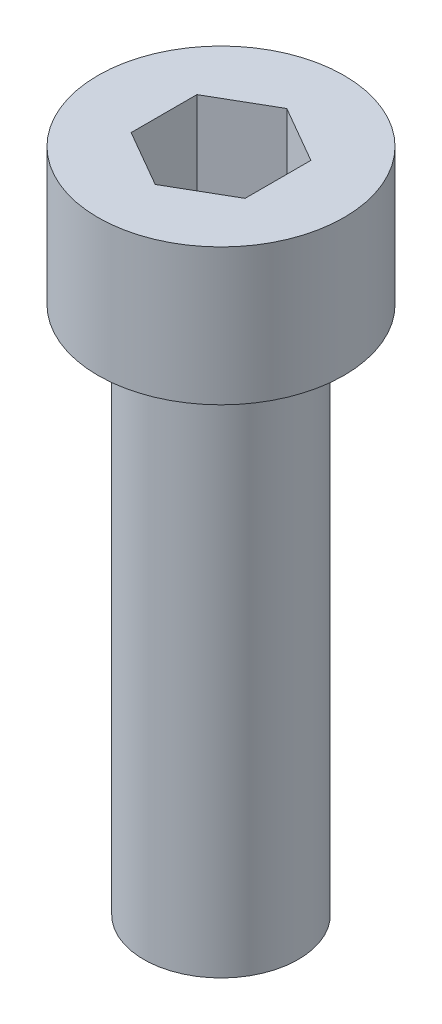
ISO-10303-21;
HEADER;
FILE_DESCRIPTION(('STEP AP214'),'2;1');
FILE_NAME('part.step','',(''),(''),'','','');
FILE_SCHEMA(('AUTOMOTIVE_DESIGN { 1 0 10303 214 1 1 1 1 }'));
ENDSEC;
DATA;
#1=APPLICATION_CONTEXT('core data for automotive mechanical design processes');
#2=APPLICATION_PROTOCOL_DEFINITION('international standard','automotive_design',2000,#1);
#3=PRODUCT_CONTEXT('',#1,'mechanical');
#4=PRODUCT('Part','Part','',(#3));
#5=PRODUCT_RELATED_PRODUCT_CATEGORY('part','',(#4));
#6=PRODUCT_DEFINITION_FORMATION('','',#4);
#7=PRODUCT_DEFINITION_CONTEXT('part definition',#1,'design');
#8=PRODUCT_DEFINITION('design','',#6,#7);
#9=PRODUCT_DEFINITION_SHAPE('','',#8);
#10=(LENGTH_UNIT() NAMED_UNIT(*) SI_UNIT(.MILLI.,.METRE.));
#11=(NAMED_UNIT(*) PLANE_ANGLE_UNIT() SI_UNIT($,.RADIAN.));
#12=(NAMED_UNIT(*) SI_UNIT($,.STERADIAN.) SOLID_ANGLE_UNIT());
#13=UNCERTAINTY_MEASURE_WITH_UNIT(LENGTH_MEASURE(1.E-05),#10,'distance_accuracy_value','');
#14=(GEOMETRIC_REPRESENTATION_CONTEXT(3) GLOBAL_UNCERTAINTY_ASSIGNED_CONTEXT((#13)) GLOBAL_UNIT_ASSIGNED_CONTEXT((#10,
#11,#12)) REPRESENTATION_CONTEXT('',''));
#15=CARTESIAN_POINT('',(0.,0.,0.));
#16=DIRECTION('',(0.,0.,1.));
#17=DIRECTION('',(1.,0.,0.));
#18=AXIS2_PLACEMENT_3D('',#15,#16,#17);
#19=CARTESIAN_POINT('',(184.714490271524,-3.,125.244295140347));
#20=DIRECTION('',(0.,1.,0.));
#21=DIRECTION('',(0.,0.,1.));
#22=AXIS2_PLACEMENT_3D('',#19,#20,#21);
#23=CYLINDRICAL_SURFACE('',#22,2.70000000000001);
#24=CARTESIAN_POINT('',(184.714490271524,-3.,125.244295140347));
#25=DIRECTION('',(0.,1.,0.));
#26=DIRECTION('',(0.,0.,1.));
#27=AXIS2_PLACEMENT_3D('',#24,#25,#26);
#28=CIRCLE('',#27,2.70000000000001);
#29=CARTESIAN_POINT('',(184.714490271524,-3.,127.944295140347));
#30=VERTEX_POINT('',#29);
#31=EDGE_CURVE('E48',#30,#30,#28,.T.);
#32=ORIENTED_EDGE('',*,*,#31,.T.);
#33=EDGE_LOOP('',(#32));
#34=FACE_BOUND('',#33,.T.);
#35=CARTESIAN_POINT('',(184.714490271524,0.,125.244295140347));
#36=DIRECTION('',(0.,1.,0.));
#37=DIRECTION('',(0.,0.,1.));
#38=AXIS2_PLACEMENT_3D('',#35,#36,#37);
#39=CIRCLE('',#38,2.70000000000001);
#40=CARTESIAN_POINT('',(184.714490271524,0.,127.944295140347));
#41=VERTEX_POINT('',#40);
#42=EDGE_CURVE('E42',#41,#41,#39,.T.);
#43=ORIENTED_EDGE('',*,*,#42,.F.);
#44=EDGE_LOOP('',(#43));
#45=FACE_BOUND('',#44,.T.);
#46=ADVANCED_FACE('F39',(#34,#45),#23,.T.);
#47=CARTESIAN_POINT('',(184.714490271524,-3.,125.244295140347));
#48=DIRECTION('',(0.,1.,0.));
#49=DIRECTION('',(0.,0.,1.));
#50=AXIS2_PLACEMENT_3D('',#47,#48,#49);
#51=PLANE('',#50);
#52=CARTESIAN_POINT('',(184.714490271524,-3.,125.244295140347));
#53=DIRECTION('',(0.,-1.,0.));
#54=DIRECTION('',(0.,0.,-1.));
#55=AXIS2_PLACEMENT_3D('',#52,#53,#54);
#56=CIRCLE('',#55,1.69629374220996);
#57=CARTESIAN_POINT('',(184.714490271524,-3.,123.548001398137));
#58=VERTEX_POINT('',#57);
#59=EDGE_CURVE('E11',#58,#58,#56,.T.);
#60=ORIENTED_EDGE('',*,*,#59,.F.);
#61=EDGE_LOOP('',(#60));
#62=FACE_BOUND('',#61,.T.);
#63=ORIENTED_EDGE('',*,*,#31,.F.);
#64=EDGE_LOOP('',(#63));
#65=FACE_BOUND('',#64,.T.);
#66=ADVANCED_FACE('F184',(#62,#65),#51,.F.);
#67=CARTESIAN_POINT('',(184.714490271524,0.,125.244295140347));
#68=DIRECTION('',(0.,1.,0.));
#69=DIRECTION('',(0.,0.,1.));
#70=AXIS2_PLACEMENT_3D('',#67,#68,#69);
#71=PLANE('',#70);
#72=DIRECTION('',(-0.866025403784435,0.,-0.500000000000006));
#73=VECTOR('',#72,1.);
#74=CARTESIAN_POINT('',(185.964490271524,0.,124.52260730386));
#75=LINE('',#74,#73);
#76=CARTESIAN_POINT('',(185.964490271524,0.,124.52260730386));
#77=VERTEX_POINT('',#76);
#78=CARTESIAN_POINT('',(184.714490271524,0.,123.800919467373));
#79=VERTEX_POINT('',#78);
#80=EDGE_CURVE('E59',#77,#79,#75,.T.);
#81=ORIENTED_EDGE('',*,*,#80,.F.);
#82=DIRECTION('',(0.,0.,-1.));
#83=VECTOR('',#82,1.);
#84=CARTESIAN_POINT('',(185.964490271524,0.,125.965982976834));
#85=LINE('',#84,#83);
#86=CARTESIAN_POINT('',(185.964490271524,0.,125.965982976834));
#87=VERTEX_POINT('',#86);
#88=EDGE_CURVE('E158',#87,#77,#85,.T.);
#89=ORIENTED_EDGE('',*,*,#88,.F.);
#90=DIRECTION('',(0.86602540378443,0.,-0.500000000000015));
#91=VECTOR('',#90,1.);
#92=CARTESIAN_POINT('',(184.714490271524,0.,126.687670813321));
#93=LINE('',#92,#91);
#94=CARTESIAN_POINT('',(184.714490271524,0.,126.687670813321));
#95=VERTEX_POINT('',#94);
#96=EDGE_CURVE('E156',#95,#87,#93,.T.);
#97=ORIENTED_EDGE('',*,*,#96,.F.);
#98=DIRECTION('',(0.866025403784436,0.,0.500000000000004));
#99=VECTOR('',#98,1.);
#100=CARTESIAN_POINT('',(183.464490271524,0.,125.965982976834));
#101=LINE('',#100,#99);
#102=CARTESIAN_POINT('',(183.464490271524,0.,125.965982976834));
#103=VERTEX_POINT('',#102);
#104=EDGE_CURVE('E114',#103,#95,#101,.T.);
#105=ORIENTED_EDGE('',*,*,#104,.F.);
#106=DIRECTION('',(0.,0.,1.));
#107=VECTOR('',#106,1.);
#108=CARTESIAN_POINT('',(183.464490271524,0.,124.52260730386));
#109=LINE('',#108,#107);
#110=CARTESIAN_POINT('',(183.464490271524,0.,124.52260730386));
#111=VERTEX_POINT('',#110);
#112=EDGE_CURVE('E150',#111,#103,#109,.T.);
#113=ORIENTED_EDGE('',*,*,#112,.F.);
#114=DIRECTION('',(-0.86602540378444,0.,0.499999999999998));
#115=VECTOR('',#114,1.);
#116=CARTESIAN_POINT('',(184.714490271524,0.,123.800919467373));
#117=LINE('',#116,#115);
#118=EDGE_CURVE('E146',#79,#111,#117,.T.);
#119=ORIENTED_EDGE('',*,*,#118,.F.);
#120=EDGE_LOOP('',(#81,#89,#97,#105,#113,#119));
#121=FACE_BOUND('',#120,.T.);
#122=ORIENTED_EDGE('',*,*,#42,.T.);
#123=EDGE_LOOP('',(#122));
#124=FACE_BOUND('',#123,.T.);
#125=ADVANCED_FACE('F181',(#121,#124),#71,.T.);
#126=CARTESIAN_POINT('',(184.714490271524,-14.6,125.244295140347));
#127=DIRECTION('',(0.,1.,0.));
#128=DIRECTION('',(0.,0.,1.));
#129=AXIS2_PLACEMENT_3D('',#126,#127,#128);
#130=CYLINDRICAL_SURFACE('',#129,1.69629374220996);
#131=CARTESIAN_POINT('',(184.714490271524,-14.6,125.244295140347));
#132=DIRECTION('',(0.,-1.,0.));
#133=DIRECTION('',(0.,0.,-1.));
#134=AXIS2_PLACEMENT_3D('',#131,#132,#133);
#135=CIRCLE('',#134,1.69629374220996);
#136=CARTESIAN_POINT('',(184.714490271524,-14.6,123.548001398137));
#137=VERTEX_POINT('',#136);
#138=EDGE_CURVE('E164',#137,#137,#135,.T.);
#139=ORIENTED_EDGE('',*,*,#138,.F.);
#140=EDGE_LOOP('',(#139));
#141=FACE_BOUND('',#140,.T.);
#142=ORIENTED_EDGE('',*,*,#59,.T.);
#143=EDGE_LOOP('',(#142));
#144=FACE_BOUND('',#143,.T.);
#145=ADVANCED_FACE('F193',(#141,#144),#130,.T.);
#146=CARTESIAN_POINT('',(184.714490271524,-14.6,125.244295140347));
#147=DIRECTION('',(0.,-1.,0.));
#148=DIRECTION('',(0.,0.,-1.));
#149=AXIS2_PLACEMENT_3D('',#146,#147,#148);
#150=PLANE('',#149);
#151=ORIENTED_EDGE('',*,*,#138,.T.);
#152=EDGE_LOOP('',(#151));
#153=FACE_BOUND('',#152,.T.);
#154=ADVANCED_FACE('F200',(#153),#150,.T.);
#155=CARTESIAN_POINT('',(185.964490271524,-2.,124.52260730386));
#156=DIRECTION('',(0.500000000000006,0.,-0.866025403784435));
#157=DIRECTION('',(-0.866025403784435,0.,-0.500000000000006));
#158=AXIS2_PLACEMENT_3D('',#155,#156,#157);
#159=PLANE('',#158);
#160=ORIENTED_EDGE('',*,*,#80,.T.);
#161=DIRECTION('',(0.,1.,0.));
#162=VECTOR('',#161,1.);
#163=CARTESIAN_POINT('',(184.714490271524,-2.,123.800919467373));
#164=LINE('',#163,#162);
#165=CARTESIAN_POINT('',(184.714490271524,-2.,123.800919467373));
#166=VERTEX_POINT('',#165);
#167=EDGE_CURVE('E96',#166,#79,#164,.T.);
#168=ORIENTED_EDGE('',*,*,#167,.F.);
#169=DIRECTION('',(-0.866025403784435,0.,-0.500000000000006));
#170=VECTOR('',#169,1.);
#171=CARTESIAN_POINT('',(185.964490271524,-2.,124.52260730386));
#172=LINE('',#171,#170);
#173=CARTESIAN_POINT('',(185.964490271524,-2.,124.52260730386));
#174=VERTEX_POINT('',#173);
#175=EDGE_CURVE('E161',#174,#166,#172,.T.);
#176=ORIENTED_EDGE('',*,*,#175,.F.);
#177=DIRECTION('',(0.,1.,0.));
#178=VECTOR('',#177,1.);
#179=CARTESIAN_POINT('',(185.964490271524,-2.,124.52260730386));
#180=LINE('',#179,#178);
#181=EDGE_CURVE('E70',#174,#77,#180,.T.);
#182=ORIENTED_EDGE('',*,*,#181,.T.);
#183=EDGE_LOOP('',(#160,#168,#176,#182));
#184=FACE_BOUND('',#183,.T.);
#185=ADVANCED_FACE('F204',(#184),#159,.F.);
#186=CARTESIAN_POINT('',(185.964490271524,-2.,125.965982976834));
#187=DIRECTION('',(1.,0.,0.));
#188=DIRECTION('',(0.,0.,-1.));
#189=AXIS2_PLACEMENT_3D('',#186,#187,#188);
#190=PLANE('',#189);
#191=ORIENTED_EDGE('',*,*,#88,.T.);
#192=ORIENTED_EDGE('',*,*,#181,.F.);
#193=DIRECTION('',(0.,0.,-1.));
#194=VECTOR('',#193,1.);
#195=CARTESIAN_POINT('',(185.964490271524,-2.,125.965982976834));
#196=LINE('',#195,#194);
#197=CARTESIAN_POINT('',(185.964490271524,-2.,125.965982976834));
#198=VERTEX_POINT('',#197);
#199=EDGE_CURVE('E127',#198,#174,#196,.T.);
#200=ORIENTED_EDGE('',*,*,#199,.F.);
#201=DIRECTION('',(0.,1.,0.));
#202=VECTOR('',#201,1.);
#203=CARTESIAN_POINT('',(185.964490271524,-2.,125.965982976834));
#204=LINE('',#203,#202);
#205=EDGE_CURVE('E118',#198,#87,#204,.T.);
#206=ORIENTED_EDGE('',*,*,#205,.T.);
#207=EDGE_LOOP('',(#191,#192,#200,#206));
#208=FACE_BOUND('',#207,.T.);
#209=ADVANCED_FACE('F208',(#208),#190,.F.);
#210=CARTESIAN_POINT('',(184.714490271524,-2.,126.687670813321));
#211=DIRECTION('',(0.500000000000015,0.,0.86602540378443));
#212=DIRECTION('',(0.86602540378443,0.,-0.500000000000015));
#213=AXIS2_PLACEMENT_3D('',#210,#211,#212);
#214=PLANE('',#213);
#215=ORIENTED_EDGE('',*,*,#96,.T.);
#216=ORIENTED_EDGE('',*,*,#205,.F.);
#217=DIRECTION('',(0.86602540378443,0.,-0.500000000000015));
#218=VECTOR('',#217,1.);
#219=CARTESIAN_POINT('',(184.714490271524,-2.,126.687670813321));
#220=LINE('',#219,#218);
#221=CARTESIAN_POINT('',(184.714490271524,-2.,126.687670813321));
#222=VERTEX_POINT('',#221);
#223=EDGE_CURVE('E122',#222,#198,#220,.T.);
#224=ORIENTED_EDGE('',*,*,#223,.F.);
#225=DIRECTION('',(0.,1.,0.));
#226=VECTOR('',#225,1.);
#227=CARTESIAN_POINT('',(184.714490271524,-2.,126.687670813321));
#228=LINE('',#227,#226);
#229=EDGE_CURVE('E107',#222,#95,#228,.T.);
#230=ORIENTED_EDGE('',*,*,#229,.T.);
#231=EDGE_LOOP('',(#215,#216,#224,#230));
#232=FACE_BOUND('',#231,.T.);
#233=ADVANCED_FACE('F123',(#232),#214,.F.);
#234=CARTESIAN_POINT('',(183.464490271524,-2.,125.965982976834));
#235=DIRECTION('',(-0.500000000000004,0.,0.866025403784436));
#236=DIRECTION('',(0.866025403784436,0.,0.500000000000004));
#237=AXIS2_PLACEMENT_3D('',#234,#235,#236);
#238=PLANE('',#237);
#239=ORIENTED_EDGE('',*,*,#104,.T.);
#240=ORIENTED_EDGE('',*,*,#229,.F.);
#241=DIRECTION('',(0.866025403784436,0.,0.500000000000004));
#242=VECTOR('',#241,1.);
#243=CARTESIAN_POINT('',(183.464490271524,-2.,125.965982976834));
#244=LINE('',#243,#242);
#245=CARTESIAN_POINT('',(183.464490271524,-2.,125.965982976834));
#246=VERTEX_POINT('',#245);
#247=EDGE_CURVE('E111',#246,#222,#244,.T.);
#248=ORIENTED_EDGE('',*,*,#247,.F.);
#249=DIRECTION('',(0.,1.,0.));
#250=VECTOR('',#249,1.);
#251=CARTESIAN_POINT('',(183.464490271524,-2.,125.965982976834));
#252=LINE('',#251,#250);
#253=EDGE_CURVE('E119',#246,#103,#252,.T.);
#254=ORIENTED_EDGE('',*,*,#253,.T.);
#255=EDGE_LOOP('',(#239,#240,#248,#254));
#256=FACE_BOUND('',#255,.T.);
#257=ADVANCED_FACE('F109',(#256),#238,.F.);
#258=CARTESIAN_POINT('',(183.464490271524,-2.,124.52260730386));
#259=DIRECTION('',(-1.,0.,0.));
#260=DIRECTION('',(0.,0.,1.));
#261=AXIS2_PLACEMENT_3D('',#258,#259,#260);
#262=PLANE('',#261);
#263=ORIENTED_EDGE('',*,*,#112,.T.);
#264=ORIENTED_EDGE('',*,*,#253,.F.);
#265=DIRECTION('',(0.,0.,1.));
#266=VECTOR('',#265,1.);
#267=CARTESIAN_POINT('',(183.464490271524,-2.,124.52260730386));
#268=LINE('',#267,#266);
#269=CARTESIAN_POINT('',(183.464490271524,-2.,124.52260730386));
#270=VERTEX_POINT('',#269);
#271=EDGE_CURVE('E133',#270,#246,#268,.T.);
#272=ORIENTED_EDGE('',*,*,#271,.F.);
#273=DIRECTION('',(0.,1.,0.));
#274=VECTOR('',#273,1.);
#275=CARTESIAN_POINT('',(183.464490271524,-2.,124.52260730386));
#276=LINE('',#275,#274);
#277=EDGE_CURVE('E168',#270,#111,#276,.T.);
#278=ORIENTED_EDGE('',*,*,#277,.T.);
#279=EDGE_LOOP('',(#263,#264,#272,#278));
#280=FACE_BOUND('',#279,.T.);
#281=ADVANCED_FACE('F212',(#280),#262,.F.);
#282=CARTESIAN_POINT('',(184.714490271524,-2.,123.800919467373));
#283=DIRECTION('',(-0.499999999999998,0.,-0.86602540378444));
#284=DIRECTION('',(-0.86602540378444,0.,0.499999999999998));
#285=AXIS2_PLACEMENT_3D('',#282,#283,#284);
#286=PLANE('',#285);
#287=ORIENTED_EDGE('',*,*,#118,.T.);
#288=ORIENTED_EDGE('',*,*,#277,.F.);
#289=DIRECTION('',(-0.86602540378444,0.,0.499999999999998));
#290=VECTOR('',#289,1.);
#291=CARTESIAN_POINT('',(184.714490271524,-2.,123.800919467373));
#292=LINE('',#291,#290);
#293=EDGE_CURVE('E139',#166,#270,#292,.T.);
#294=ORIENTED_EDGE('',*,*,#293,.F.);
#295=ORIENTED_EDGE('',*,*,#167,.T.);
#296=EDGE_LOOP('',(#287,#288,#294,#295));
#297=FACE_BOUND('',#296,.T.);
#298=ADVANCED_FACE('F209',(#297),#286,.F.);
#299=CARTESIAN_POINT('',(0.,-2.,0.));
#300=DIRECTION('',(0.,1.,0.));
#301=DIRECTION('',(0.,0.,1.));
#302=AXIS2_PLACEMENT_3D('',#299,#300,#301);
#303=PLANE('',#302);
#304=ORIENTED_EDGE('',*,*,#175,.T.);
#305=ORIENTED_EDGE('',*,*,#293,.T.);
#306=ORIENTED_EDGE('',*,*,#271,.T.);
#307=ORIENTED_EDGE('',*,*,#247,.T.);
#308=ORIENTED_EDGE('',*,*,#223,.T.);
#309=ORIENTED_EDGE('',*,*,#199,.T.);
#310=EDGE_LOOP('',(#304,#305,#306,#307,#308,#309));
#311=FACE_BOUND('',#310,.T.);
#312=ADVANCED_FACE('F130',(#311),#303,.T.);
#313=CLOSED_SHELL('',(#46,#66,#125,#145,#154,#185,#209,#233,#257,#281,#298,#312));
#314=MANIFOLD_SOLID_BREP('B2',#313);
#315=ADVANCED_BREP_SHAPE_REPRESENTATION('',(#18,#314),#14);
#316=SHAPE_DEFINITION_REPRESENTATION(#9,#315);
ENDSEC;
END-ISO-10303-21;
